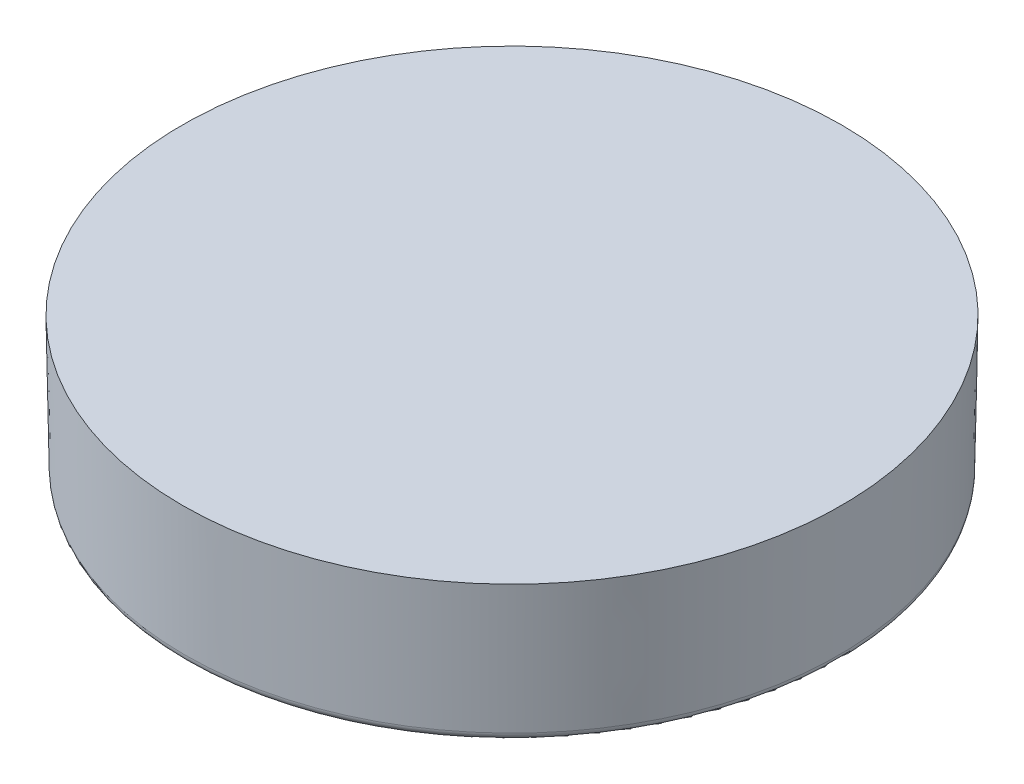
ISO-10303-21;
HEADER;
FILE_DESCRIPTION(('STEP AP214'),'2;1');
FILE_NAME('part.step','',(''),(''),'','','');
FILE_SCHEMA(('AUTOMOTIVE_DESIGN { 1 0 10303 214 1 1 1 1 }'));
ENDSEC;
DATA;
#1=APPLICATION_CONTEXT('core data for automotive mechanical design processes');
#2=APPLICATION_PROTOCOL_DEFINITION('international standard','automotive_design',2000,#1);
#3=PRODUCT_CONTEXT('',#1,'mechanical');
#4=PRODUCT('Part','Part','',(#3));
#5=PRODUCT_RELATED_PRODUCT_CATEGORY('part','',(#4));
#6=PRODUCT_DEFINITION_FORMATION('','',#4);
#7=PRODUCT_DEFINITION_CONTEXT('part definition',#1,'design');
#8=PRODUCT_DEFINITION('design','',#6,#7);
#9=PRODUCT_DEFINITION_SHAPE('','',#8);
#10=(LENGTH_UNIT() NAMED_UNIT(*) SI_UNIT(.MILLI.,.METRE.));
#11=(NAMED_UNIT(*) PLANE_ANGLE_UNIT() SI_UNIT($,.RADIAN.));
#12=(NAMED_UNIT(*) SI_UNIT($,.STERADIAN.) SOLID_ANGLE_UNIT());
#13=UNCERTAINTY_MEASURE_WITH_UNIT(LENGTH_MEASURE(1.E-05),#10,'distance_accuracy_value','');
#14=(GEOMETRIC_REPRESENTATION_CONTEXT(3) GLOBAL_UNCERTAINTY_ASSIGNED_CONTEXT((#13)) GLOBAL_UNIT_ASSIGNED_CONTEXT((#10,
#11,#12)) REPRESENTATION_CONTEXT('',''));
#15=CARTESIAN_POINT('',(0.,0.,0.));
#16=DIRECTION('',(0.,0.,1.));
#17=DIRECTION('',(1.,0.,0.));
#18=AXIS2_PLACEMENT_3D('',#15,#16,#17);
#19=CARTESIAN_POINT('',(0.,0.,0.));
#20=DIRECTION('',(0.,1.,0.));
#21=DIRECTION('',(0.,0.,1.));
#22=AXIS2_PLACEMENT_3D('',#19,#20,#21);
#23=CONICAL_SURFACE('',#22,15.08125,0.0174532925199433);
#24=CARTESIAN_POINT('',(0.,-5.9756493668526,0.));
#25=DIRECTION('',(0.,1.,0.));
#26=DIRECTION('',(0.,0.,1.));
#27=AXIS2_PLACEMENT_3D('',#24,#25,#26);
#28=CIRCLE('',#27,14.9769446523133);
#29=CARTESIAN_POINT('',(0.,-5.9756493668526,14.9769446523133));
#30=VERTEX_POINT('',#29);
#31=EDGE_CURVE('E50',#30,#30,#28,.T.);
#32=ORIENTED_EDGE('',*,*,#31,.T.);
#33=EDGE_LOOP('',(#32));
#34=FACE_BOUND('',#33,.T.);
#35=CARTESIAN_POINT('',(0.,0.,0.));
#36=DIRECTION('',(0.,1.,0.));
#37=DIRECTION('',(0.,0.,1.));
#38=AXIS2_PLACEMENT_3D('',#35,#36,#37);
#39=CIRCLE('',#38,15.08125);
#40=CARTESIAN_POINT('',(0.,0.,15.08125));
#41=VERTEX_POINT('',#40);
#42=EDGE_CURVE('E56',#41,#41,#39,.T.);
#43=ORIENTED_EDGE('',*,*,#42,.F.);
#44=EDGE_LOOP('',(#43));
#45=FACE_BOUND('',#44,.T.);
#46=ADVANCED_FACE('F35',(#34,#45),#23,.T.);
#47=CARTESIAN_POINT('',(0.,0.,0.));
#48=DIRECTION('',(0.,1.,0.));
#49=DIRECTION('',(0.,0.,1.));
#50=AXIS2_PLACEMENT_3D('',#47,#48,#49);
#51=PLANE('',#50);
#52=ORIENTED_EDGE('',*,*,#42,.T.);
#53=EDGE_LOOP('',(#52));
#54=FACE_BOUND('',#53,.T.);
#55=ADVANCED_FACE('F77',(#54),#51,.T.);
#56=CARTESIAN_POINT('',(0.,-2.3114,0.));
#57=DIRECTION('',(0.,-1.,0.));
#58=DIRECTION('',(0.,0.,1.));
#59=AXIS2_PLACEMENT_3D('',#56,#57,#58);
#60=CONICAL_SURFACE('',#59,13.3435956370751,0.174532925199433);
#61=CARTESIAN_POINT('',(0.,-6.03515995569111,0.));
#62=DIRECTION('',(0.,1.,0.));
#63=DIRECTION('',(0.,0.,1.));
#64=AXIS2_PLACEMENT_3D('',#61,#62,#63);
#65=CIRCLE('',#64,14.0001949869452);
#66=CARTESIAN_POINT('',(0.,-6.03515995569111,14.0001949869452));
#67=VERTEX_POINT('',#66);
#68=EDGE_CURVE('E10',#67,#67,#65,.F.);
#69=ORIENTED_EDGE('',*,*,#68,.T.);
#70=EDGE_LOOP('',(#69));
#71=FACE_BOUND('',#70,.T.);
#72=CARTESIAN_POINT('',(0.,-2.3114,0.));
#73=DIRECTION('',(0.,1.,0.));
#74=DIRECTION('',(0.,0.,1.));
#75=AXIS2_PLACEMENT_3D('',#72,#73,#74);
#76=CIRCLE('',#75,13.3435956370751);
#77=CARTESIAN_POINT('',(0.,-2.3114,13.3435956370751));
#78=VERTEX_POINT('',#77);
#79=EDGE_CURVE('E55',#78,#78,#76,.T.);
#80=ORIENTED_EDGE('',*,*,#79,.T.);
#81=EDGE_LOOP('',(#80));
#82=FACE_BOUND('',#81,.T.);
#83=ADVANCED_FACE('F62',(#71,#82),#60,.F.);
#84=CARTESIAN_POINT('',(0.,-6.35,0.));
#85=DIRECTION('',(0.,1.,0.));
#86=DIRECTION('',(0.,0.,1.));
#87=AXIS2_PLACEMENT_3D('',#84,#85,#86);
#88=PLANE('',#87);
#89=CARTESIAN_POINT('',(0.,-6.35,0.));
#90=DIRECTION('',(0.,1.,0.));
#91=DIRECTION('',(0.,0.,1.));
#92=AXIS2_PLACEMENT_3D('',#89,#90,#91);
#93=CIRCLE('',#92,14.5960026804587);
#94=CARTESIAN_POINT('',(0.,-6.35,14.5960026804587));
#95=VERTEX_POINT('',#94);
#96=EDGE_CURVE('E42',#95,#95,#93,.F.);
#97=ORIENTED_EDGE('',*,*,#96,.T.);
#98=EDGE_LOOP('',(#97));
#99=FACE_BOUND('',#98,.T.);
#100=CARTESIAN_POINT('',(0.,-6.35,0.));
#101=DIRECTION('',(0.,1.,0.));
#102=DIRECTION('',(0.,0.,1.));
#103=AXIS2_PLACEMENT_3D('',#100,#101,#102);
#104=CIRCLE('',#103,14.3754067408428);
#105=CARTESIAN_POINT('',(0.,-6.35,14.3754067408428));
#106=VERTEX_POINT('',#105);
#107=EDGE_CURVE('E46',#106,#106,#104,.T.);
#108=ORIENTED_EDGE('',*,*,#107,.T.);
#109=EDGE_LOOP('',(#108));
#110=FACE_BOUND('',#109,.T.);
#111=ADVANCED_FACE('F67',(#99,#110),#88,.F.);
#112=CARTESIAN_POINT('',(0.,-2.3114,0.));
#113=DIRECTION('',(0.,1.,0.));
#114=DIRECTION('',(0.,0.,1.));
#115=AXIS2_PLACEMENT_3D('',#112,#113,#114);
#116=PLANE('',#115);
#117=ORIENTED_EDGE('',*,*,#79,.F.);
#118=EDGE_LOOP('',(#117));
#119=FACE_BOUND('',#118,.T.);
#120=ADVANCED_FACE('F64',(#119),#116,.F.);
#121=CARTESIAN_POINT('',(0.,-5.969,0.));
#122=DIRECTION('',(0.,1.,0.));
#123=DIRECTION('',(0.,0.,1.));
#124=AXIS2_PLACEMENT_3D('',#121,#122,#123);
#125=TOROIDAL_SURFACE('',#124,14.5960026804587,0.381);
#126=ORIENTED_EDGE('',*,*,#96,.F.);
#127=EDGE_LOOP('',(#126));
#128=FACE_BOUND('',#127,.T.);
#129=ORIENTED_EDGE('',*,*,#31,.F.);
#130=EDGE_LOOP('',(#129));
#131=FACE_BOUND('',#130,.T.);
#132=ADVANCED_FACE('F66',(#128,#131),#125,.T.);
#133=CARTESIAN_POINT('',(0.,-5.969,0.));
#134=DIRECTION('',(0.,1.,0.));
#135=DIRECTION('',(0.,0.,1.));
#136=AXIS2_PLACEMENT_3D('',#133,#134,#135);
#137=TOROIDAL_SURFACE('',#136,14.3754067408428,0.381);
#138=ORIENTED_EDGE('',*,*,#68,.F.);
#139=EDGE_LOOP('',(#138));
#140=FACE_BOUND('',#139,.T.);
#141=ORIENTED_EDGE('',*,*,#107,.F.);
#142=EDGE_LOOP('',(#141));
#143=FACE_BOUND('',#142,.T.);
#144=ADVANCED_FACE('F37',(#140,#143),#137,.T.);
#145=CLOSED_SHELL('',(#46,#55,#83,#111,#120,#132,#144));
#146=MANIFOLD_SOLID_BREP('B2',#145);
#147=ADVANCED_BREP_SHAPE_REPRESENTATION('',(#18,#146),#14);
#148=SHAPE_DEFINITION_REPRESENTATION(#9,#147);
ENDSEC;
END-ISO-10303-21;
